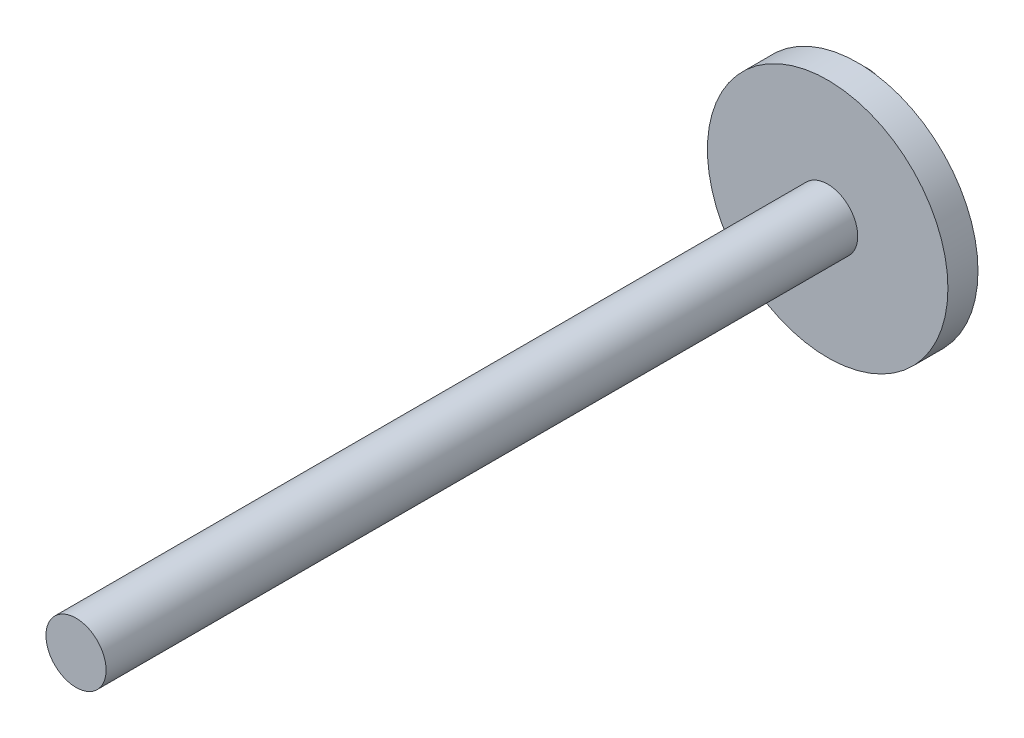
ISO-10303-21;
HEADER;
FILE_DESCRIPTION(('STEP AP214'),'2;1');
FILE_NAME('part.step','',(''),(''),'','','');
FILE_SCHEMA(('AUTOMOTIVE_DESIGN { 1 0 10303 214 1 1 1 1 }'));
ENDSEC;
DATA;
#1=APPLICATION_CONTEXT('core data for automotive mechanical design processes');
#2=APPLICATION_PROTOCOL_DEFINITION('international standard','automotive_design',2000,#1);
#3=PRODUCT_CONTEXT('',#1,'mechanical');
#4=PRODUCT('Part','Part','',(#3));
#5=PRODUCT_RELATED_PRODUCT_CATEGORY('part','',(#4));
#6=PRODUCT_DEFINITION_FORMATION('','',#4);
#7=PRODUCT_DEFINITION_CONTEXT('part definition',#1,'design');
#8=PRODUCT_DEFINITION('design','',#6,#7);
#9=PRODUCT_DEFINITION_SHAPE('','',#8);
#10=(LENGTH_UNIT() NAMED_UNIT(*) SI_UNIT(.MILLI.,.METRE.));
#11=(NAMED_UNIT(*) PLANE_ANGLE_UNIT() SI_UNIT($,.RADIAN.));
#12=(NAMED_UNIT(*) SI_UNIT($,.STERADIAN.) SOLID_ANGLE_UNIT());
#13=UNCERTAINTY_MEASURE_WITH_UNIT(LENGTH_MEASURE(1.E-05),#10,'distance_accuracy_value','');
#14=(GEOMETRIC_REPRESENTATION_CONTEXT(3) GLOBAL_UNCERTAINTY_ASSIGNED_CONTEXT((#13)) GLOBAL_UNIT_ASSIGNED_CONTEXT((#10,
#11,#12)) REPRESENTATION_CONTEXT('',''));
#15=CARTESIAN_POINT('',(0.,0.,0.));
#16=DIRECTION('',(0.,0.,1.));
#17=DIRECTION('',(1.,0.,0.));
#18=AXIS2_PLACEMENT_3D('',#15,#16,#17);
#19=CARTESIAN_POINT('',(0.,0.,10.));
#20=DIRECTION('',(0.,0.,-1.));
#21=DIRECTION('',(-1.,0.,0.));
#22=AXIS2_PLACEMENT_3D('',#19,#20,#21);
#23=CYLINDRICAL_SURFACE('',#22,40.);
#24=CARTESIAN_POINT('',(0.,0.,10.));
#25=DIRECTION('',(0.,0.,1.));
#26=DIRECTION('',(1.,0.,0.));
#27=AXIS2_PLACEMENT_3D('',#24,#25,#26);
#28=CIRCLE('',#27,40.);
#29=CARTESIAN_POINT('',(40.,0.,10.));
#30=VERTEX_POINT('',#29);
#31=EDGE_CURVE('E53',#30,#30,#28,.T.);
#32=ORIENTED_EDGE('',*,*,#31,.F.);
#33=EDGE_LOOP('',(#32));
#34=FACE_BOUND('',#33,.T.);
#35=CARTESIAN_POINT('',(0.,0.,0.));
#36=DIRECTION('',(0.,0.,1.));
#37=DIRECTION('',(1.,0.,0.));
#38=AXIS2_PLACEMENT_3D('',#35,#36,#37);
#39=CIRCLE('',#38,40.);
#40=CARTESIAN_POINT('',(40.,0.,0.));
#41=VERTEX_POINT('',#40);
#42=EDGE_CURVE('E59',#41,#41,#39,.T.);
#43=ORIENTED_EDGE('',*,*,#42,.T.);
#44=EDGE_LOOP('',(#43));
#45=FACE_BOUND('',#44,.T.);
#46=ADVANCED_FACE('F41',(#34,#45),#23,.T.);
#47=CARTESIAN_POINT('',(0.,0.,10.));
#48=DIRECTION('',(0.,0.,1.));
#49=DIRECTION('',(1.,0.,0.));
#50=AXIS2_PLACEMENT_3D('',#47,#48,#49);
#51=PLANE('',#50);
#52=CARTESIAN_POINT('',(0.,0.,10.));
#53=DIRECTION('',(0.,0.,1.));
#54=DIRECTION('',(1.,0.,0.));
#55=AXIS2_PLACEMENT_3D('',#52,#53,#54);
#56=CIRCLE('',#55,10.);
#57=CARTESIAN_POINT('',(10.,0.,10.));
#58=VERTEX_POINT('',#57);
#59=EDGE_CURVE('E48',#58,#58,#56,.T.);
#60=ORIENTED_EDGE('',*,*,#59,.F.);
#61=EDGE_LOOP('',(#60));
#62=FACE_BOUND('',#61,.T.);
#63=ORIENTED_EDGE('',*,*,#31,.T.);
#64=EDGE_LOOP('',(#63));
#65=FACE_BOUND('',#64,.T.);
#66=ADVANCED_FACE('F91',(#62,#65),#51,.T.);
#67=CARTESIAN_POINT('',(0.,0.,0.));
#68=DIRECTION('',(0.,0.,1.));
#69=DIRECTION('',(1.,0.,0.));
#70=AXIS2_PLACEMENT_3D('',#67,#68,#69);
#71=PLANE('',#70);
#72=CARTESIAN_POINT('',(-26.9985619159408,0.,0.));
#73=DIRECTION('',(0.,0.,1.));
#74=DIRECTION('',(1.,0.,0.));
#75=AXIS2_PLACEMENT_3D('',#72,#73,#74);
#76=CIRCLE('',#75,10.);
#77=CARTESIAN_POINT('',(-16.9985619159408,0.,0.));
#78=VERTEX_POINT('',#77);
#79=EDGE_CURVE('E10',#78,#78,#76,.F.);
#80=ORIENTED_EDGE('',*,*,#79,.F.);
#81=EDGE_LOOP('',(#80));
#82=FACE_BOUND('',#81,.T.);
#83=ORIENTED_EDGE('',*,*,#42,.F.);
#84=EDGE_LOOP('',(#83));
#85=FACE_BOUND('',#84,.T.);
#86=ADVANCED_FACE('F96',(#82,#85),#71,.F.);
#87=CARTESIAN_POINT('',(0.,0.,260.));
#88=DIRECTION('',(0.,0.,-1.));
#89=DIRECTION('',(-1.,0.,0.));
#90=AXIS2_PLACEMENT_3D('',#87,#88,#89);
#91=CYLINDRICAL_SURFACE('',#90,10.);
#92=CARTESIAN_POINT('',(0.,0.,260.));
#93=DIRECTION('',(0.,0.,1.));
#94=DIRECTION('',(1.,0.,0.));
#95=AXIS2_PLACEMENT_3D('',#92,#93,#94);
#96=CIRCLE('',#95,10.);
#97=CARTESIAN_POINT('',(10.,0.,260.));
#98=VERTEX_POINT('',#97);
#99=EDGE_CURVE('E62',#98,#98,#96,.T.);
#100=ORIENTED_EDGE('',*,*,#99,.F.);
#101=EDGE_LOOP('',(#100));
#102=FACE_BOUND('',#101,.T.);
#103=ORIENTED_EDGE('',*,*,#59,.T.);
#104=EDGE_LOOP('',(#103));
#105=FACE_BOUND('',#104,.T.);
#106=ADVANCED_FACE('F88',(#102,#105),#91,.T.);
#107=CARTESIAN_POINT('',(0.,0.,260.));
#108=DIRECTION('',(0.,0.,1.));
#109=DIRECTION('',(1.,0.,0.));
#110=AXIS2_PLACEMENT_3D('',#107,#108,#109);
#111=PLANE('',#110);
#112=ORIENTED_EDGE('',*,*,#99,.T.);
#113=EDGE_LOOP('',(#112));
#114=FACE_BOUND('',#113,.T.);
#115=ADVANCED_FACE('F81',(#114),#111,.T.);
#116=CARTESIAN_POINT('',(-26.9985619159408,0.,-30.));
#117=DIRECTION('',(0.,0.,1.));
#118=DIRECTION('',(1.,0.,0.));
#119=AXIS2_PLACEMENT_3D('',#116,#117,#118);
#120=CYLINDRICAL_SURFACE('',#119,10.);
#121=CARTESIAN_POINT('',(-26.9985619159408,0.,-30.));
#122=DIRECTION('',(0.,0.,-1.));
#123=DIRECTION('',(-1.,0.,0.));
#124=AXIS2_PLACEMENT_3D('',#121,#122,#123);
#125=CIRCLE('',#124,10.);
#126=CARTESIAN_POINT('',(-36.9985619159408,0.,-30.));
#127=VERTEX_POINT('',#126);
#128=EDGE_CURVE('E70',#127,#127,#125,.T.);
#129=ORIENTED_EDGE('',*,*,#128,.F.);
#130=EDGE_LOOP('',(#129));
#131=FACE_BOUND('',#130,.T.);
#132=ORIENTED_EDGE('',*,*,#79,.T.);
#133=EDGE_LOOP('',(#132));
#134=FACE_BOUND('',#133,.T.);
#135=ADVANCED_FACE('F79',(#131,#134),#120,.T.);
#136=CARTESIAN_POINT('',(-26.9985619159408,0.,-30.));
#137=DIRECTION('',(0.,0.,-1.));
#138=DIRECTION('',(-1.,0.,0.));
#139=AXIS2_PLACEMENT_3D('',#136,#137,#138);
#140=PLANE('',#139);
#141=ORIENTED_EDGE('',*,*,#128,.T.);
#142=EDGE_LOOP('',(#141));
#143=FACE_BOUND('',#142,.T.);
#144=ADVANCED_FACE('F77',(#143),#140,.T.);
#145=CLOSED_SHELL('',(#46,#66,#86,#106,#115,#135,#144));
#146=MANIFOLD_SOLID_BREP('B2',#145);
#147=ADVANCED_BREP_SHAPE_REPRESENTATION('',(#18,#146),#14);
#148=SHAPE_DEFINITION_REPRESENTATION(#9,#147);
ENDSEC;
END-ISO-10303-21;
